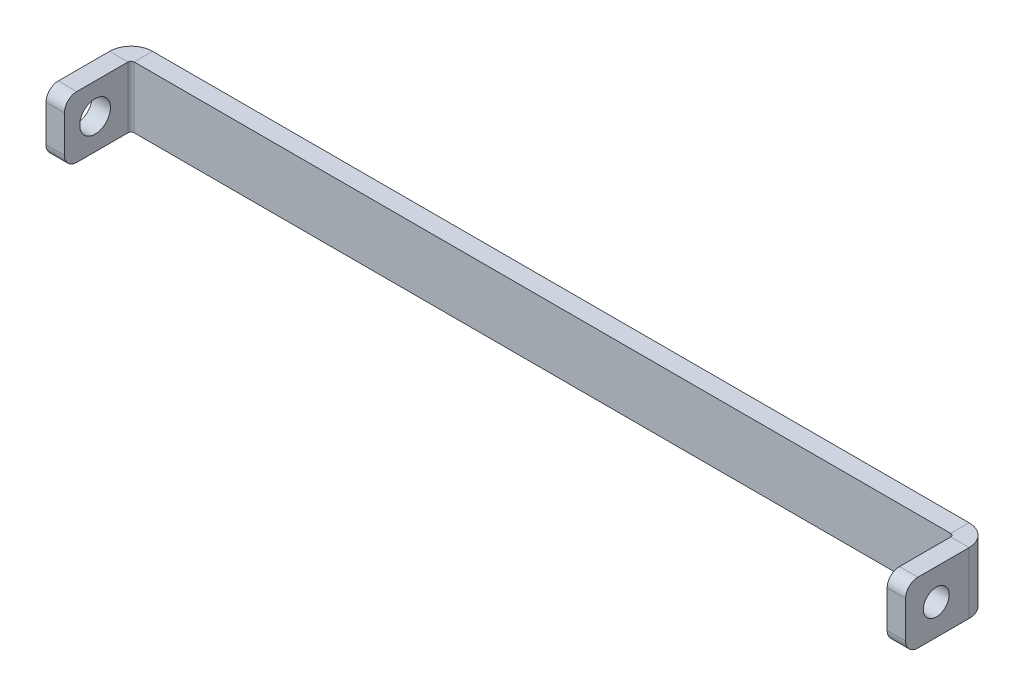
ISO-10303-21;
HEADER;
FILE_DESCRIPTION(('STEP AP214'),'2;1');
FILE_NAME('part.step','',(''),(''),'','','');
FILE_SCHEMA(('AUTOMOTIVE_DESIGN { 1 0 10303 214 1 1 1 1 }'));
ENDSEC;
DATA;
#1=APPLICATION_CONTEXT('core data for automotive mechanical design processes');
#2=APPLICATION_PROTOCOL_DEFINITION('international standard','automotive_design',2000,#1);
#3=PRODUCT_CONTEXT('',#1,'mechanical');
#4=PRODUCT('Part','Part','',(#3));
#5=PRODUCT_RELATED_PRODUCT_CATEGORY('part','',(#4));
#6=PRODUCT_DEFINITION_FORMATION('','',#4);
#7=PRODUCT_DEFINITION_CONTEXT('part definition',#1,'design');
#8=PRODUCT_DEFINITION('design','',#6,#7);
#9=PRODUCT_DEFINITION_SHAPE('','',#8);
#10=(LENGTH_UNIT() NAMED_UNIT(*) SI_UNIT(.MILLI.,.METRE.));
#11=(NAMED_UNIT(*) PLANE_ANGLE_UNIT() SI_UNIT($,.RADIAN.));
#12=(NAMED_UNIT(*) SI_UNIT($,.STERADIAN.) SOLID_ANGLE_UNIT());
#13=UNCERTAINTY_MEASURE_WITH_UNIT(LENGTH_MEASURE(1.E-05),#10,'distance_accuracy_value','');
#14=(GEOMETRIC_REPRESENTATION_CONTEXT(3) GLOBAL_UNCERTAINTY_ASSIGNED_CONTEXT((#13)) GLOBAL_UNIT_ASSIGNED_CONTEXT((#10,
#11,#12)) REPRESENTATION_CONTEXT('',''));
#15=CARTESIAN_POINT('',(0.,0.,0.));
#16=DIRECTION('',(0.,0.,1.));
#17=DIRECTION('',(1.,0.,0.));
#18=AXIS2_PLACEMENT_3D('',#15,#16,#17);
#19=CARTESIAN_POINT('',(89.0480311033268,16.3228628146841,-3.));
#20=DIRECTION('',(0.,0.,-1.));
#21=DIRECTION('',(-1.,0.,0.));
#22=AXIS2_PLACEMENT_3D('',#19,#20,#21);
#23=PLANE('',#22);
#24=DIRECTION('',(-1.,0.,0.));
#25=VECTOR('',#24,1.);
#26=CARTESIAN_POINT('',(-66.9519688966731,24.3228628146841,-3.));
#27=LINE('',#26,#25);
#28=CARTESIAN_POINT('',(77.5480311033269,24.3228628146841,-3.));
#29=VERTEX_POINT('',#28);
#30=CARTESIAN_POINT('',(-55.4519688966732,24.3228628146841,-3.));
#31=VERTEX_POINT('',#30);
#32=EDGE_CURVE('E299',#29,#31,#27,.T.);
#33=ORIENTED_EDGE('',*,*,#32,.F.);
#34=DIRECTION('',(0.,-1.,0.));
#35=VECTOR('',#34,1.);
#36=CARTESIAN_POINT('',(77.5480311033269,16.3228628146841,-3.));
#37=LINE('',#36,#35);
#38=CARTESIAN_POINT('',(77.5480311033269,14.3228628146841,-3.));
#39=VERTEX_POINT('',#38);
#40=EDGE_CURVE('E290',#29,#39,#37,.T.);
#41=ORIENTED_EDGE('',*,*,#40,.T.);
#42=DIRECTION('',(1.,0.,0.));
#43=VECTOR('',#42,1.);
#44=CARTESIAN_POINT('',(89.0480311033268,14.3228628146841,-3.));
#45=LINE('',#44,#43);
#46=CARTESIAN_POINT('',(-55.4519688966732,14.3228628146841,-3.));
#47=VERTEX_POINT('',#46);
#48=EDGE_CURVE('E282',#47,#39,#45,.T.);
#49=ORIENTED_EDGE('',*,*,#48,.F.);
#50=DIRECTION('',(0.,-1.,0.));
#51=VECTOR('',#50,1.);
#52=CARTESIAN_POINT('',(-55.4519688966732,16.3228628146841,-3.));
#53=LINE('',#52,#51);
#54=EDGE_CURVE('E278',#31,#47,#53,.T.);
#55=ORIENTED_EDGE('',*,*,#54,.F.);
#56=EDGE_LOOP('',(#33,#41,#49,#55));
#57=FACE_BOUND('',#56,.T.);
#58=ADVANCED_FACE('F51',(#57),#23,.T.);
#59=CARTESIAN_POINT('',(-66.9519688966731,24.3228628146841,-3.));
#60=DIRECTION('',(0.,1.,0.));
#61=DIRECTION('',(0.,0.,1.));
#62=AXIS2_PLACEMENT_3D('',#59,#60,#61);
#63=PLANE('',#62);
#64=DIRECTION('',(-1.,0.,0.));
#65=VECTOR('',#64,1.);
#66=CARTESIAN_POINT('',(-66.9519688966731,24.3228628146841,0.));
#67=LINE('',#66,#65);
#68=CARTESIAN_POINT('',(77.5480311033269,24.3228628146841,0.));
#69=VERTEX_POINT('',#68);
#70=CARTESIAN_POINT('',(-55.4519688966732,24.3228628146841,0.));
#71=VERTEX_POINT('',#70);
#72=EDGE_CURVE('E74',#69,#71,#67,.T.);
#73=ORIENTED_EDGE('',*,*,#72,.F.);
#74=DIRECTION('',(0.,0.,-1.));
#75=VECTOR('',#74,1.);
#76=CARTESIAN_POINT('',(77.5480311033269,24.3228628146841,-3.));
#77=LINE('',#76,#75);
#78=EDGE_CURVE('E293',#69,#29,#77,.T.);
#79=ORIENTED_EDGE('',*,*,#78,.T.);
#80=ORIENTED_EDGE('',*,*,#32,.T.);
#81=DIRECTION('',(0.,0.,-1.));
#82=VECTOR('',#81,1.);
#83=CARTESIAN_POINT('',(-55.4519688966732,24.3228628146841,-3.));
#84=LINE('',#83,#82);
#85=EDGE_CURVE('E287',#71,#31,#84,.T.);
#86=ORIENTED_EDGE('',*,*,#85,.F.);
#87=EDGE_LOOP('',(#73,#79,#80,#86));
#88=FACE_BOUND('',#87,.T.);
#89=ADVANCED_FACE('F306',(#88),#63,.T.);
#90=CARTESIAN_POINT('',(89.0480311033268,14.3228628146841,-3.));
#91=DIRECTION('',(0.,-1.,0.));
#92=DIRECTION('',(1.,0.,0.));
#93=AXIS2_PLACEMENT_3D('',#90,#91,#92);
#94=PLANE('',#93);
#95=ORIENTED_EDGE('',*,*,#48,.T.);
#96=DIRECTION('',(0.,0.,1.));
#97=VECTOR('',#96,1.);
#98=CARTESIAN_POINT('',(77.5480311033269,14.3228628146841,-3.));
#99=LINE('',#98,#97);
#100=CARTESIAN_POINT('',(77.5480311033269,14.3228628146841,0.));
#101=VERTEX_POINT('',#100);
#102=EDGE_CURVE('E12',#39,#101,#99,.T.);
#103=ORIENTED_EDGE('',*,*,#102,.T.);
#104=DIRECTION('',(1.,0.,0.));
#105=VECTOR('',#104,1.);
#106=CARTESIAN_POINT('',(89.0480311033268,14.3228628146841,0.));
#107=LINE('',#106,#105);
#108=CARTESIAN_POINT('',(-55.4519688966732,14.3228628146841,0.));
#109=VERTEX_POINT('',#108);
#110=EDGE_CURVE('E300',#109,#101,#107,.T.);
#111=ORIENTED_EDGE('',*,*,#110,.F.);
#112=DIRECTION('',(0.,0.,1.));
#113=VECTOR('',#112,1.);
#114=CARTESIAN_POINT('',(-55.4519688966732,14.3228628146841,-3.));
#115=LINE('',#114,#113);
#116=EDGE_CURVE('E281',#47,#109,#115,.T.);
#117=ORIENTED_EDGE('',*,*,#116,.F.);
#118=EDGE_LOOP('',(#95,#103,#111,#117));
#119=FACE_BOUND('',#118,.T.);
#120=ADVANCED_FACE('F53',(#119),#94,.T.);
#121=CARTESIAN_POINT('',(89.0480311033268,16.3228628146841,0.));
#122=DIRECTION('',(0.,0.,-1.));
#123=DIRECTION('',(-1.,0.,0.));
#124=AXIS2_PLACEMENT_3D('',#121,#122,#123);
#125=PLANE('',#124);
#126=DIRECTION('',(0.,-1.,0.));
#127=VECTOR('',#126,1.);
#128=CARTESIAN_POINT('',(77.5480311033269,16.3228628146841,0.));
#129=LINE('',#128,#127);
#130=EDGE_CURVE('E60',#69,#101,#129,.T.);
#131=ORIENTED_EDGE('',*,*,#130,.F.);
#132=ORIENTED_EDGE('',*,*,#72,.T.);
#133=DIRECTION('',(0.,-1.,0.));
#134=VECTOR('',#133,1.);
#135=CARTESIAN_POINT('',(-55.4519688966732,16.3228628146841,0.));
#136=LINE('',#135,#134);
#137=EDGE_CURVE('E285',#71,#109,#136,.T.);
#138=ORIENTED_EDGE('',*,*,#137,.T.);
#139=ORIENTED_EDGE('',*,*,#110,.T.);
#140=EDGE_LOOP('',(#131,#132,#138,#139));
#141=FACE_BOUND('',#140,.T.);
#142=ADVANCED_FACE('F369',(#141),#125,.F.);
#143=CARTESIAN_POINT('',(-55.4519688966732,24.3228628146841,0.5));
#144=DIRECTION('',(0.,1.,0.));
#145=DIRECTION('',(0.,0.,1.));
#146=AXIS2_PLACEMENT_3D('',#143,#144,#145);
#147=PLANE('',#146);
#148=DIRECTION('',(-1.,0.,0.));
#149=VECTOR('',#148,1.);
#150=CARTESIAN_POINT('',(-58.9519688966732,24.3228628146841,0.500000000000014));
#151=LINE('',#150,#149);
#152=CARTESIAN_POINT('',(-55.9519688966732,24.3228628146841,0.5));
#153=VERTEX_POINT('',#152);
#154=CARTESIAN_POINT('',(-58.9519688966732,24.3228628146841,0.499999999999997));
#155=VERTEX_POINT('',#154);
#156=EDGE_CURVE('E221',#153,#155,#151,.T.);
#157=ORIENTED_EDGE('',*,*,#156,.F.);
#158=CARTESIAN_POINT('',(-55.4519688966732,24.322862814684,0.5));
#159=DIRECTION('',(0.,1.,0.));
#160=DIRECTION('',(0.,0.,1.));
#161=AXIS2_PLACEMENT_3D('',#158,#159,#160);
#162=CIRCLE('',#161,0.5);
#163=EDGE_CURVE('E218',#153,#71,#162,.F.);
#164=ORIENTED_EDGE('',*,*,#163,.T.);
#165=ORIENTED_EDGE('',*,*,#85,.T.);
#166=CARTESIAN_POINT('',(-55.4519688966732,24.3228628146841,0.5));
#167=DIRECTION('',(0.,-1.,0.));
#168=DIRECTION('',(0.,0.,1.));
#169=AXIS2_PLACEMENT_3D('',#166,#167,#168);
#170=CIRCLE('',#169,3.5);
#171=EDGE_CURVE('E267',#155,#31,#170,.T.);
#172=ORIENTED_EDGE('',*,*,#171,.F.);
#173=EDGE_LOOP('',(#157,#164,#165,#172));
#174=FACE_BOUND('',#173,.T.);
#175=ADVANCED_FACE('F312',(#174),#147,.T.);
#176=CARTESIAN_POINT('',(-55.4519688966732,14.3228628146841,0.5));
#177=DIRECTION('',(0.,-1.,0.));
#178=DIRECTION('',(0.,0.,-1.));
#179=AXIS2_PLACEMENT_3D('',#176,#177,#178);
#180=PLANE('',#179);
#181=CARTESIAN_POINT('',(-55.4519688966732,14.3228628146841,0.5));
#182=DIRECTION('',(0.,1.,0.));
#183=DIRECTION('',(0.,0.,1.));
#184=AXIS2_PLACEMENT_3D('',#181,#182,#183);
#185=CIRCLE('',#184,0.5);
#186=CARTESIAN_POINT('',(-55.9519688966732,14.3228628146841,0.499999999999987));
#187=VERTEX_POINT('',#186);
#188=EDGE_CURVE('E271',#109,#187,#185,.T.);
#189=ORIENTED_EDGE('',*,*,#188,.T.);
#190=DIRECTION('',(1.,0.,0.));
#191=VECTOR('',#190,1.);
#192=CARTESIAN_POINT('',(-58.9519688966732,14.3228628146841,0.5));
#193=LINE('',#192,#191);
#194=CARTESIAN_POINT('',(-58.9519688966732,14.3228628146841,0.5));
#195=VERTEX_POINT('',#194);
#196=EDGE_CURVE('E236',#195,#187,#193,.T.);
#197=ORIENTED_EDGE('',*,*,#196,.F.);
#198=CARTESIAN_POINT('',(-55.4519688966732,14.3228628146841,0.5));
#199=DIRECTION('',(0.,1.,0.));
#200=DIRECTION('',(0.,0.,-1.));
#201=AXIS2_PLACEMENT_3D('',#198,#199,#200);
#202=CIRCLE('',#201,3.5);
#203=EDGE_CURVE('E270',#47,#195,#202,.T.);
#204=ORIENTED_EDGE('',*,*,#203,.F.);
#205=ORIENTED_EDGE('',*,*,#116,.T.);
#206=EDGE_LOOP('',(#189,#197,#204,#205));
#207=FACE_BOUND('',#206,.T.);
#208=ADVANCED_FACE('F329',(#207),#180,.T.);
#209=CARTESIAN_POINT('',(-55.4519688966732,8.42012901067466,0.5));
#210=DIRECTION('',(0.,1.,0.));
#211=DIRECTION('',(0.,0.,1.));
#212=AXIS2_PLACEMENT_3D('',#209,#210,#211);
#213=CYLINDRICAL_SURFACE('',#212,3.5);
#214=ORIENTED_EDGE('',*,*,#54,.T.);
#215=ORIENTED_EDGE('',*,*,#203,.T.);
#216=DIRECTION('',(0.,-1.,0.));
#217=VECTOR('',#216,1.);
#218=CARTESIAN_POINT('',(-58.9519688966732,16.3228628146841,0.500000000000014));
#219=LINE('',#218,#217);
#220=EDGE_CURVE('E242',#155,#195,#219,.T.);
#221=ORIENTED_EDGE('',*,*,#220,.F.);
#222=ORIENTED_EDGE('',*,*,#171,.T.);
#223=EDGE_LOOP('',(#214,#215,#221,#222));
#224=FACE_BOUND('',#223,.T.);
#225=ADVANCED_FACE('F316',(#224),#213,.T.);
#226=CARTESIAN_POINT('',(-55.4519688966732,8.42012901067466,0.5));
#227=DIRECTION('',(0.,1.,0.));
#228=DIRECTION('',(0.,0.,1.));
#229=AXIS2_PLACEMENT_3D('',#226,#227,#228);
#230=CYLINDRICAL_SURFACE('',#229,0.5);
#231=ORIENTED_EDGE('',*,*,#137,.F.);
#232=ORIENTED_EDGE('',*,*,#163,.F.);
#233=DIRECTION('',(0.,-1.,0.));
#234=VECTOR('',#233,1.);
#235=CARTESIAN_POINT('',(-55.9519688966732,16.3228628146841,0.5));
#236=LINE('',#235,#234);
#237=EDGE_CURVE('E211',#153,#187,#236,.T.);
#238=ORIENTED_EDGE('',*,*,#237,.T.);
#239=ORIENTED_EDGE('',*,*,#188,.F.);
#240=EDGE_LOOP('',(#231,#232,#238,#239));
#241=FACE_BOUND('',#240,.T.);
#242=ADVANCED_FACE('F333',(#241),#230,.F.);
#243=CARTESIAN_POINT('',(-58.9519688966731,22.3228628146841,8.85840734641021));
#244=DIRECTION('',(1.,0.,0.));
#245=DIRECTION('',(0.,0.,-1.));
#246=AXIS2_PLACEMENT_3D('',#243,#244,#245);
#247=CYLINDRICAL_SURFACE('',#246,2.);
#248=CARTESIAN_POINT('',(-55.9519688966731,22.3228628146841,8.85840734641019));
#249=DIRECTION('',(1.,0.,0.));
#250=DIRECTION('',(0.,0.,1.));
#251=AXIS2_PLACEMENT_3D('',#248,#249,#250);
#252=CIRCLE('',#251,2.);
#253=CARTESIAN_POINT('',(-55.9519688966731,24.3228628146841,8.85840734641018));
#254=VERTEX_POINT('',#253);
#255=CARTESIAN_POINT('',(-55.9519688966731,22.322862814684,10.8584073464102));
#256=VERTEX_POINT('',#255);
#257=EDGE_CURVE('E231',#254,#256,#252,.T.);
#258=ORIENTED_EDGE('',*,*,#257,.F.);
#259=DIRECTION('',(1.,0.,0.));
#260=VECTOR('',#259,1.);
#261=CARTESIAN_POINT('',(-58.9519688966731,24.3228628146841,8.85840734641019));
#262=LINE('',#261,#260);
#263=CARTESIAN_POINT('',(-58.9519688966731,24.3228628146841,8.85840734641019));
#264=VERTEX_POINT('',#263);
#265=EDGE_CURVE('E215',#264,#254,#262,.T.);
#266=ORIENTED_EDGE('',*,*,#265,.F.);
#267=CARTESIAN_POINT('',(-58.9519688966731,22.3228628146841,8.85840734641021));
#268=DIRECTION('',(1.,0.,0.));
#269=DIRECTION('',(0.,0.,1.));
#270=AXIS2_PLACEMENT_3D('',#267,#268,#269);
#271=CIRCLE('',#270,2.);
#272=CARTESIAN_POINT('',(-58.9519688966731,22.322862814684,10.8584073464102));
#273=VERTEX_POINT('',#272);
#274=EDGE_CURVE('E262',#264,#273,#271,.T.);
#275=ORIENTED_EDGE('',*,*,#274,.T.);
#276=DIRECTION('',(1.,0.,0.));
#277=VECTOR('',#276,1.);
#278=CARTESIAN_POINT('',(-58.9519688966731,22.322862814684,10.8584073464102));
#279=LINE('',#278,#277);
#280=EDGE_CURVE('E260',#273,#256,#279,.T.);
#281=ORIENTED_EDGE('',*,*,#280,.T.);
#282=EDGE_LOOP('',(#258,#266,#275,#281));
#283=FACE_BOUND('',#282,.T.);
#284=ADVANCED_FACE('F343',(#283),#247,.T.);
#285=CARTESIAN_POINT('',(-58.9519688966731,16.3228628146841,10.8584073464102));
#286=DIRECTION('',(0.,0.,1.));
#287=DIRECTION('',(1.,0.,0.));
#288=AXIS2_PLACEMENT_3D('',#285,#286,#287);
#289=PLANE('',#288);
#290=DIRECTION('',(0.,-1.,0.));
#291=VECTOR('',#290,1.);
#292=CARTESIAN_POINT('',(-55.9519688966731,16.3228628146841,10.8584073464102));
#293=LINE('',#292,#291);
#294=CARTESIAN_POINT('',(-55.9519688966731,16.3228628146841,10.8584073464102));
#295=VERTEX_POINT('',#294);
#296=EDGE_CURVE('E228',#256,#295,#293,.T.);
#297=ORIENTED_EDGE('',*,*,#296,.F.);
#298=ORIENTED_EDGE('',*,*,#280,.F.);
#299=DIRECTION('',(0.,-1.,0.));
#300=VECTOR('',#299,1.);
#301=CARTESIAN_POINT('',(-58.9519688966731,16.3228628146841,10.8584073464102));
#302=LINE('',#301,#300);
#303=CARTESIAN_POINT('',(-58.9519688966731,16.3228628146841,10.8584073464102));
#304=VERTEX_POINT('',#303);
#305=EDGE_CURVE('E257',#273,#304,#302,.T.);
#306=ORIENTED_EDGE('',*,*,#305,.T.);
#307=DIRECTION('',(1.,0.,0.));
#308=VECTOR('',#307,1.);
#309=CARTESIAN_POINT('',(-58.9519688966731,16.3228628146841,10.8584073464102));
#310=LINE('',#309,#308);
#311=EDGE_CURVE('E255',#304,#295,#310,.T.);
#312=ORIENTED_EDGE('',*,*,#311,.T.);
#313=EDGE_LOOP('',(#297,#298,#306,#312));
#314=FACE_BOUND('',#313,.T.);
#315=ADVANCED_FACE('F347',(#314),#289,.T.);
#316=CARTESIAN_POINT('',(-58.9519688966731,16.3228628146841,8.85840734641021));
#317=DIRECTION('',(1.,0.,0.));
#318=DIRECTION('',(0.,0.,-1.));
#319=AXIS2_PLACEMENT_3D('',#316,#317,#318);
#320=CYLINDRICAL_SURFACE('',#319,2.);
#321=CARTESIAN_POINT('',(-55.9519688966731,16.3228628146841,8.85840734641019));
#322=DIRECTION('',(1.,0.,0.));
#323=DIRECTION('',(0.,0.,1.));
#324=AXIS2_PLACEMENT_3D('',#321,#322,#323);
#325=CIRCLE('',#324,2.);
#326=CARTESIAN_POINT('',(-55.9519688966731,14.3228628146841,8.85840734641018));
#327=VERTEX_POINT('',#326);
#328=EDGE_CURVE('E225',#295,#327,#325,.T.);
#329=ORIENTED_EDGE('',*,*,#328,.F.);
#330=ORIENTED_EDGE('',*,*,#311,.F.);
#331=CARTESIAN_POINT('',(-58.9519688966731,16.3228628146841,8.85840734641021));
#332=DIRECTION('',(1.,0.,0.));
#333=DIRECTION('',(0.,0.,1.));
#334=AXIS2_PLACEMENT_3D('',#331,#332,#333);
#335=CIRCLE('',#334,2.);
#336=CARTESIAN_POINT('',(-58.9519688966731,14.3228628146841,8.85840734641019));
#337=VERTEX_POINT('',#336);
#338=EDGE_CURVE('E252',#304,#337,#335,.T.);
#339=ORIENTED_EDGE('',*,*,#338,.T.);
#340=DIRECTION('',(1.,0.,0.));
#341=VECTOR('',#340,1.);
#342=CARTESIAN_POINT('',(-58.9519688966731,14.3228628146841,8.85840734641019));
#343=LINE('',#342,#341);
#344=EDGE_CURVE('E250',#337,#327,#343,.T.);
#345=ORIENTED_EDGE('',*,*,#344,.T.);
#346=EDGE_LOOP('',(#329,#330,#339,#345));
#347=FACE_BOUND('',#346,.T.);
#348=ADVANCED_FACE('F350',(#347),#320,.T.);
#349=CARTESIAN_POINT('',(-58.9519688966731,19.3228628146841,5.8584073464102));
#350=DIRECTION('',(1.,0.,0.));
#351=DIRECTION('',(0.,0.,-1.));
#352=AXIS2_PLACEMENT_3D('',#349,#350,#351);
#353=CYLINDRICAL_SURFACE('',#352,2.5);
#354=CARTESIAN_POINT('',(-58.9519688966731,19.3228628146841,5.8584073464102));
#355=DIRECTION('',(1.,0.,0.));
#356=DIRECTION('',(0.,0.,-1.));
#357=AXIS2_PLACEMENT_3D('',#354,#355,#356);
#358=CIRCLE('',#357,2.5);
#359=CARTESIAN_POINT('',(-58.9519688966732,19.3228628146841,3.3584073464102));
#360=VERTEX_POINT('',#359);
#361=EDGE_CURVE('E244',#360,#360,#358,.T.);
#362=ORIENTED_EDGE('',*,*,#361,.F.);
#363=EDGE_LOOP('',(#362));
#364=FACE_BOUND('',#363,.T.);
#365=CARTESIAN_POINT('',(-55.9519688966732,19.3228628146841,5.85840734641019));
#366=DIRECTION('',(1.,0.,0.));
#367=DIRECTION('',(0.,0.,-1.));
#368=AXIS2_PLACEMENT_3D('',#365,#366,#367);
#369=CIRCLE('',#368,2.5);
#370=CARTESIAN_POINT('',(-55.9519688966732,19.3228628146841,3.35840734641019));
#371=VERTEX_POINT('',#370);
#372=EDGE_CURVE('E247',#371,#371,#369,.T.);
#373=ORIENTED_EDGE('',*,*,#372,.T.);
#374=EDGE_LOOP('',(#373));
#375=FACE_BOUND('',#374,.T.);
#376=ADVANCED_FACE('F352',(#364,#375),#353,.F.);
#377=CARTESIAN_POINT('',(-58.9519688966737,16.3228628146841,-147.14159265359));
#378=DIRECTION('',(-1.,0.,0.));
#379=DIRECTION('',(0.,0.,1.));
#380=AXIS2_PLACEMENT_3D('',#377,#378,#379);
#381=PLANE('',#380);
#382=ORIENTED_EDGE('',*,*,#361,.T.);
#383=EDGE_LOOP('',(#382));
#384=FACE_BOUND('',#383,.T.);
#385=DIRECTION('',(0.,0.,1.));
#386=VECTOR('',#385,1.);
#387=CARTESIAN_POINT('',(-58.9519688966731,24.3228628146841,8.85840734641019));
#388=LINE('',#387,#386);
#389=EDGE_CURVE('E219',#155,#264,#388,.T.);
#390=ORIENTED_EDGE('',*,*,#389,.F.);
#391=ORIENTED_EDGE('',*,*,#220,.T.);
#392=DIRECTION('',(0.,0.,-1.));
#393=VECTOR('',#392,1.);
#394=CARTESIAN_POINT('',(-58.9519688966737,14.3228628146841,-147.14159265359));
#395=LINE('',#394,#393);
#396=EDGE_CURVE('E239',#337,#195,#395,.T.);
#397=ORIENTED_EDGE('',*,*,#396,.F.);
#398=ORIENTED_EDGE('',*,*,#338,.F.);
#399=ORIENTED_EDGE('',*,*,#305,.F.);
#400=ORIENTED_EDGE('',*,*,#274,.F.);
#401=EDGE_LOOP('',(#390,#391,#397,#398,#399,#400));
#402=FACE_BOUND('',#401,.T.);
#403=ADVANCED_FACE('F321',(#384,#402),#381,.T.);
#404=CARTESIAN_POINT('',(-58.9519688966737,14.3228628146841,-147.14159265359));
#405=DIRECTION('',(0.,-1.,0.));
#406=DIRECTION('',(0.,0.,-1.));
#407=AXIS2_PLACEMENT_3D('',#404,#405,#406);
#408=PLANE('',#407);
#409=ORIENTED_EDGE('',*,*,#396,.T.);
#410=ORIENTED_EDGE('',*,*,#196,.T.);
#411=DIRECTION('',(0.,0.,-1.));
#412=VECTOR('',#411,1.);
#413=CARTESIAN_POINT('',(-55.9519688966737,14.3228628146841,-147.14159265359));
#414=LINE('',#413,#412);
#415=EDGE_CURVE('E223',#327,#187,#414,.T.);
#416=ORIENTED_EDGE('',*,*,#415,.F.);
#417=ORIENTED_EDGE('',*,*,#344,.F.);
#418=EDGE_LOOP('',(#409,#410,#416,#417));
#419=FACE_BOUND('',#418,.T.);
#420=ADVANCED_FACE('F326',(#419),#408,.T.);
#421=CARTESIAN_POINT('',(-55.9519688966737,16.3228628146841,-147.14159265359));
#422=DIRECTION('',(-1.,0.,0.));
#423=DIRECTION('',(0.,0.,1.));
#424=AXIS2_PLACEMENT_3D('',#421,#422,#423);
#425=PLANE('',#424);
#426=ORIENTED_EDGE('',*,*,#237,.F.);
#427=DIRECTION('',(0.,0.,1.));
#428=VECTOR('',#427,1.);
#429=CARTESIAN_POINT('',(-55.9519688966731,24.3228628146841,8.85840734641018));
#430=LINE('',#429,#428);
#431=EDGE_CURVE('E234',#153,#254,#430,.T.);
#432=ORIENTED_EDGE('',*,*,#431,.T.);
#433=ORIENTED_EDGE('',*,*,#257,.T.);
#434=ORIENTED_EDGE('',*,*,#296,.T.);
#435=ORIENTED_EDGE('',*,*,#328,.T.);
#436=ORIENTED_EDGE('',*,*,#415,.T.);
#437=EDGE_LOOP('',(#426,#432,#433,#434,#435,#436));
#438=FACE_BOUND('',#437,.T.);
#439=ORIENTED_EDGE('',*,*,#372,.F.);
#440=EDGE_LOOP('',(#439));
#441=FACE_BOUND('',#440,.T.);
#442=ADVANCED_FACE('F336',(#438,#441),#425,.F.);
#443=CARTESIAN_POINT('',(-58.9519688966731,24.3228628146841,8.85840734641019));
#444=DIRECTION('',(0.,1.,0.));
#445=DIRECTION('',(1.,0.,0.));
#446=AXIS2_PLACEMENT_3D('',#443,#444,#445);
#447=PLANE('',#446);
#448=ORIENTED_EDGE('',*,*,#431,.F.);
#449=ORIENTED_EDGE('',*,*,#156,.T.);
#450=ORIENTED_EDGE('',*,*,#389,.T.);
#451=ORIENTED_EDGE('',*,*,#265,.T.);
#452=EDGE_LOOP('',(#448,#449,#450,#451));
#453=FACE_BOUND('',#452,.T.);
#454=ADVANCED_FACE('F339',(#453),#447,.T.);
#455=CARTESIAN_POINT('',(77.5480311033269,24.3228628146841,0.5));
#456=DIRECTION('',(0.,1.,0.));
#457=DIRECTION('',(0.,0.,1.));
#458=AXIS2_PLACEMENT_3D('',#455,#456,#457);
#459=PLANE('',#458);
#460=ORIENTED_EDGE('',*,*,#78,.F.);
#461=CARTESIAN_POINT('',(77.5480311033269,24.3228628146841,0.5));
#462=DIRECTION('',(0.,-1.,0.));
#463=DIRECTION('',(0.,0.,-1.));
#464=AXIS2_PLACEMENT_3D('',#461,#462,#463);
#465=CIRCLE('',#464,0.5);
#466=CARTESIAN_POINT('',(78.0480311033269,24.3228628146841,0.5));
#467=VERTEX_POINT('',#466);
#468=EDGE_CURVE('E186',#69,#467,#465,.T.);
#469=ORIENTED_EDGE('',*,*,#468,.T.);
#470=DIRECTION('',(1.,0.,0.));
#471=VECTOR('',#470,1.);
#472=CARTESIAN_POINT('',(81.0480311033269,24.3228628146841,0.500000000000014));
#473=LINE('',#472,#471);
#474=CARTESIAN_POINT('',(81.0480311033269,24.3228628146841,0.500000000000014));
#475=VERTEX_POINT('',#474);
#476=EDGE_CURVE('E194',#467,#475,#473,.T.);
#477=ORIENTED_EDGE('',*,*,#476,.T.);
#478=CARTESIAN_POINT('',(77.5480311033269,24.3228628146841,0.5));
#479=DIRECTION('',(0.,-1.,0.));
#480=DIRECTION('',(0.,0.,1.));
#481=AXIS2_PLACEMENT_3D('',#478,#479,#480);
#482=CIRCLE('',#481,3.5);
#483=EDGE_CURVE('E204',#29,#475,#482,.T.);
#484=ORIENTED_EDGE('',*,*,#483,.F.);
#485=EDGE_LOOP('',(#460,#469,#477,#484));
#486=FACE_BOUND('',#485,.T.);
#487=ADVANCED_FACE('F395',(#486),#459,.T.);
#488=CARTESIAN_POINT('',(77.5480311033269,14.3228628146841,0.5));
#489=DIRECTION('',(0.,-1.,0.));
#490=DIRECTION('',(0.,0.,-1.));
#491=AXIS2_PLACEMENT_3D('',#488,#489,#490);
#492=PLANE('',#491);
#493=DIRECTION('',(-1.,0.,0.));
#494=VECTOR('',#493,1.);
#495=CARTESIAN_POINT('',(81.0480311033269,14.3228628146841,0.500000000000014));
#496=LINE('',#495,#494);
#497=CARTESIAN_POINT('',(81.0480311033269,14.3228628146841,0.500000000000023));
#498=VERTEX_POINT('',#497);
#499=CARTESIAN_POINT('',(78.0480311033269,14.3228628146841,0.5));
#500=VERTEX_POINT('',#499);
#501=EDGE_CURVE('E174',#498,#500,#496,.T.);
#502=ORIENTED_EDGE('',*,*,#501,.T.);
#503=CARTESIAN_POINT('',(77.5480311033269,14.3228628146841,0.5));
#504=DIRECTION('',(0.,-1.,0.));
#505=DIRECTION('',(0.,0.,-1.));
#506=AXIS2_PLACEMENT_3D('',#503,#504,#505);
#507=CIRCLE('',#506,0.5);
#508=EDGE_CURVE('E208',#500,#101,#507,.F.);
#509=ORIENTED_EDGE('',*,*,#508,.T.);
#510=ORIENTED_EDGE('',*,*,#102,.F.);
#511=CARTESIAN_POINT('',(77.5480311033269,14.3228628146841,0.5));
#512=DIRECTION('',(0.,1.,0.));
#513=DIRECTION('',(0.,0.,-1.));
#514=AXIS2_PLACEMENT_3D('',#511,#512,#513);
#515=CIRCLE('',#514,3.5);
#516=EDGE_CURVE('E207',#498,#39,#515,.T.);
#517=ORIENTED_EDGE('',*,*,#516,.F.);
#518=EDGE_LOOP('',(#502,#509,#510,#517));
#519=FACE_BOUND('',#518,.T.);
#520=ADVANCED_FACE('F378',(#519),#492,.T.);
#521=CARTESIAN_POINT('',(77.5480311033269,30.2255966186935,0.5));
#522=DIRECTION('',(0.,-1.,0.));
#523=DIRECTION('',(0.,0.,-1.));
#524=AXIS2_PLACEMENT_3D('',#521,#522,#523);
#525=CYLINDRICAL_SURFACE('',#524,3.5);
#526=ORIENTED_EDGE('',*,*,#516,.T.);
#527=ORIENTED_EDGE('',*,*,#40,.F.);
#528=ORIENTED_EDGE('',*,*,#483,.T.);
#529=DIRECTION('',(0.,-1.,0.));
#530=VECTOR('',#529,1.);
#531=CARTESIAN_POINT('',(81.0480311033269,16.3228628146841,0.500000000000014));
#532=LINE('',#531,#530);
#533=EDGE_CURVE('E202',#475,#498,#532,.T.);
#534=ORIENTED_EDGE('',*,*,#533,.T.);
#535=EDGE_LOOP('',(#526,#527,#528,#534));
#536=FACE_BOUND('',#535,.T.);
#537=ADVANCED_FACE('F381',(#536),#525,.T.);
#538=CARTESIAN_POINT('',(77.5480311033269,30.2255966186935,0.5));
#539=DIRECTION('',(0.,-1.,0.));
#540=DIRECTION('',(0.,0.,-1.));
#541=AXIS2_PLACEMENT_3D('',#538,#539,#540);
#542=CYLINDRICAL_SURFACE('',#541,0.5);
#543=ORIENTED_EDGE('',*,*,#508,.F.);
#544=DIRECTION('',(0.,-1.,0.));
#545=VECTOR('',#544,1.);
#546=CARTESIAN_POINT('',(78.0480311033269,16.3228628146841,0.5));
#547=LINE('',#546,#545);
#548=EDGE_CURVE('E398',#467,#500,#547,.T.);
#549=ORIENTED_EDGE('',*,*,#548,.F.);
#550=ORIENTED_EDGE('',*,*,#468,.F.);
#551=ORIENTED_EDGE('',*,*,#130,.T.);
#552=EDGE_LOOP('',(#543,#549,#550,#551));
#553=FACE_BOUND('',#552,.T.);
#554=ADVANCED_FACE('F396',(#553),#542,.F.);
#555=CARTESIAN_POINT('',(81.0480311033268,16.3228628146841,8.85840734641019));
#556=DIRECTION('',(-1.,0.,0.));
#557=DIRECTION('',(0.,0.,1.));
#558=AXIS2_PLACEMENT_3D('',#555,#556,#557);
#559=CYLINDRICAL_SURFACE('',#558,2.);
#560=CARTESIAN_POINT('',(78.0480311033268,16.3228628146841,8.85840734641018));
#561=DIRECTION('',(-1.,0.,0.));
#562=DIRECTION('',(0.,0.,-1.));
#563=AXIS2_PLACEMENT_3D('',#560,#561,#562);
#564=CIRCLE('',#563,2.);
#565=CARTESIAN_POINT('',(78.0480311033268,14.3228628146841,8.85840734641016));
#566=VERTEX_POINT('',#565);
#567=CARTESIAN_POINT('',(78.0480311033268,16.3228628146841,10.8584073464102));
#568=VERTEX_POINT('',#567);
#569=EDGE_CURVE('E185',#566,#568,#564,.T.);
#570=ORIENTED_EDGE('',*,*,#569,.F.);
#571=DIRECTION('',(-1.,0.,0.));
#572=VECTOR('',#571,1.);
#573=CARTESIAN_POINT('',(81.0480311033268,14.3228628146841,8.85840734641018));
#574=LINE('',#573,#572);
#575=CARTESIAN_POINT('',(81.0480311033268,14.3228628146841,8.85840734641018));
#576=VERTEX_POINT('',#575);
#577=EDGE_CURVE('E171',#576,#566,#574,.T.);
#578=ORIENTED_EDGE('',*,*,#577,.F.);
#579=CARTESIAN_POINT('',(81.0480311033268,16.3228628146841,8.85840734641019));
#580=DIRECTION('',(-1.,0.,0.));
#581=DIRECTION('',(0.,0.,-1.));
#582=AXIS2_PLACEMENT_3D('',#579,#580,#581);
#583=CIRCLE('',#582,2.);
#584=CARTESIAN_POINT('',(81.0480311033268,16.3228628146841,10.8584073464102));
#585=VERTEX_POINT('',#584);
#586=EDGE_CURVE('E183',#576,#585,#583,.T.);
#587=ORIENTED_EDGE('',*,*,#586,.T.);
#588=DIRECTION('',(-1.,0.,0.));
#589=VECTOR('',#588,1.);
#590=CARTESIAN_POINT('',(81.0480311033268,16.3228628146841,10.8584073464102));
#591=LINE('',#590,#589);
#592=EDGE_CURVE('E193',#585,#568,#591,.T.);
#593=ORIENTED_EDGE('',*,*,#592,.T.);
#594=EDGE_LOOP('',(#570,#578,#587,#593));
#595=FACE_BOUND('',#594,.T.);
#596=ADVANCED_FACE('F182',(#595),#559,.T.);
#597=CARTESIAN_POINT('',(81.0480311033268,22.322862814684,10.8584073464102));
#598=DIRECTION('',(0.,0.,1.));
#599=DIRECTION('',(1.,0.,0.));
#600=AXIS2_PLACEMENT_3D('',#597,#598,#599);
#601=PLANE('',#600);
#602=DIRECTION('',(0.,1.,0.));
#603=VECTOR('',#602,1.);
#604=CARTESIAN_POINT('',(78.0480311033268,22.322862814684,10.8584073464102));
#605=LINE('',#604,#603);
#606=CARTESIAN_POINT('',(78.0480311033268,22.322862814684,10.8584073464102));
#607=VERTEX_POINT('',#606);
#608=EDGE_CURVE('E415',#568,#607,#605,.T.);
#609=ORIENTED_EDGE('',*,*,#608,.F.);
#610=ORIENTED_EDGE('',*,*,#592,.F.);
#611=DIRECTION('',(0.,1.,0.));
#612=VECTOR('',#611,1.);
#613=CARTESIAN_POINT('',(81.0480311033268,22.322862814684,10.8584073464102));
#614=LINE('',#613,#612);
#615=CARTESIAN_POINT('',(81.0480311033268,22.322862814684,10.8584073464102));
#616=VERTEX_POINT('',#615);
#617=EDGE_CURVE('E192',#585,#616,#614,.T.);
#618=ORIENTED_EDGE('',*,*,#617,.T.);
#619=DIRECTION('',(-1.,0.,0.));
#620=VECTOR('',#619,1.);
#621=CARTESIAN_POINT('',(81.0480311033268,22.322862814684,10.8584073464102));
#622=LINE('',#621,#620);
#623=EDGE_CURVE('E409',#616,#607,#622,.T.);
#624=ORIENTED_EDGE('',*,*,#623,.T.);
#625=EDGE_LOOP('',(#609,#610,#618,#624));
#626=FACE_BOUND('',#625,.T.);
#627=ADVANCED_FACE('F412',(#626),#601,.T.);
#628=CARTESIAN_POINT('',(81.0480311033268,22.3228628146841,8.85840734641019));
#629=DIRECTION('',(-1.,0.,0.));
#630=DIRECTION('',(0.,0.,1.));
#631=AXIS2_PLACEMENT_3D('',#628,#629,#630);
#632=CYLINDRICAL_SURFACE('',#631,2.);
#633=CARTESIAN_POINT('',(78.0480311033268,22.3228628146841,8.85840734641018));
#634=DIRECTION('',(-1.,0.,0.));
#635=DIRECTION('',(0.,0.,-1.));
#636=AXIS2_PLACEMENT_3D('',#633,#634,#635);
#637=CIRCLE('',#636,2.);
#638=CARTESIAN_POINT('',(78.0480311033268,24.3228628146841,8.85840734641016));
#639=VERTEX_POINT('',#638);
#640=EDGE_CURVE('E178',#607,#639,#637,.T.);
#641=ORIENTED_EDGE('',*,*,#640,.F.);
#642=ORIENTED_EDGE('',*,*,#623,.F.);
#643=CARTESIAN_POINT('',(81.0480311033268,22.3228628146841,8.85840734641019));
#644=DIRECTION('',(-1.,0.,0.));
#645=DIRECTION('',(0.,0.,-1.));
#646=AXIS2_PLACEMENT_3D('',#643,#644,#645);
#647=CIRCLE('',#646,2.);
#648=CARTESIAN_POINT('',(81.0480311033268,24.3228628146841,8.85840734641018));
#649=VERTEX_POINT('',#648);
#650=EDGE_CURVE('E407',#616,#649,#647,.T.);
#651=ORIENTED_EDGE('',*,*,#650,.T.);
#652=DIRECTION('',(-1.,0.,0.));
#653=VECTOR('',#652,1.);
#654=CARTESIAN_POINT('',(81.0480311033268,24.3228628146841,8.85840734641018));
#655=LINE('',#654,#653);
#656=EDGE_CURVE('E391',#649,#639,#655,.T.);
#657=ORIENTED_EDGE('',*,*,#656,.T.);
#658=EDGE_LOOP('',(#641,#642,#651,#657));
#659=FACE_BOUND('',#658,.T.);
#660=ADVANCED_FACE('F441',(#659),#632,.T.);
#661=CARTESIAN_POINT('',(81.0480311033268,16.3228628146841,8.85840734641019));
#662=DIRECTION('',(1.,0.,0.));
#663=DIRECTION('',(0.,0.,-1.));
#664=AXIS2_PLACEMENT_3D('',#661,#662,#663);
#665=PLANE('',#664);
#666=CARTESIAN_POINT('',(81.0480311033268,19.3228628146841,5.85840734641019));
#667=DIRECTION('',(1.,0.,0.));
#668=DIRECTION('',(0.,0.,-1.));
#669=AXIS2_PLACEMENT_3D('',#666,#667,#668);
#670=CIRCLE('',#669,2.09999999999999);
#671=CARTESIAN_POINT('',(81.0480311033268,19.3228628146841,3.7584073464102));
#672=VERTEX_POINT('',#671);
#673=EDGE_CURVE('E421',#672,#672,#670,.T.);
#674=ORIENTED_EDGE('',*,*,#673,.F.);
#675=EDGE_LOOP('',(#674));
#676=FACE_BOUND('',#675,.T.);
#677=ORIENTED_EDGE('',*,*,#533,.F.);
#678=DIRECTION('',(0.,0.,-1.));
#679=VECTOR('',#678,1.);
#680=CARTESIAN_POINT('',(81.0480311033274,24.3228628146841,-147.14159265359));
#681=LINE('',#680,#679);
#682=EDGE_CURVE('E384',#649,#475,#681,.T.);
#683=ORIENTED_EDGE('',*,*,#682,.F.);
#684=ORIENTED_EDGE('',*,*,#650,.F.);
#685=ORIENTED_EDGE('',*,*,#617,.F.);
#686=ORIENTED_EDGE('',*,*,#586,.F.);
#687=DIRECTION('',(0.,0.,1.));
#688=VECTOR('',#687,1.);
#689=CARTESIAN_POINT('',(81.0480311033268,14.3228628146841,8.85840734641018));
#690=LINE('',#689,#688);
#691=EDGE_CURVE('E168',#498,#576,#690,.T.);
#692=ORIENTED_EDGE('',*,*,#691,.F.);
#693=EDGE_LOOP('',(#677,#683,#684,#685,#686,#692));
#694=FACE_BOUND('',#693,.T.);
#695=ADVANCED_FACE('F189',(#676,#694),#665,.T.);
#696=CARTESIAN_POINT('',(81.0480311033274,24.3228628146841,-147.14159265359));
#697=DIRECTION('',(0.,1.,0.));
#698=DIRECTION('',(-1.,0.,0.));
#699=AXIS2_PLACEMENT_3D('',#696,#697,#698);
#700=PLANE('',#699);
#701=ORIENTED_EDGE('',*,*,#476,.F.);
#702=DIRECTION('',(0.,0.,-1.));
#703=VECTOR('',#702,1.);
#704=CARTESIAN_POINT('',(78.0480311033274,24.3228628146841,-147.14159265359));
#705=LINE('',#704,#703);
#706=EDGE_CURVE('E392',#639,#467,#705,.T.);
#707=ORIENTED_EDGE('',*,*,#706,.F.);
#708=ORIENTED_EDGE('',*,*,#656,.F.);
#709=ORIENTED_EDGE('',*,*,#682,.T.);
#710=EDGE_LOOP('',(#701,#707,#708,#709));
#711=FACE_BOUND('',#710,.T.);
#712=ADVANCED_FACE('F388',(#711),#700,.T.);
#713=CARTESIAN_POINT('',(78.0480311033268,16.3228628146841,8.85840734641018));
#714=DIRECTION('',(1.,0.,0.));
#715=DIRECTION('',(0.,0.,-1.));
#716=AXIS2_PLACEMENT_3D('',#713,#714,#715);
#717=PLANE('',#716);
#718=CARTESIAN_POINT('',(78.0480311033268,19.3228628146841,5.85840734641018));
#719=DIRECTION('',(1.,0.,0.));
#720=DIRECTION('',(0.,0.,-1.));
#721=AXIS2_PLACEMENT_3D('',#718,#719,#720);
#722=CIRCLE('',#721,2.09999999999999);
#723=CARTESIAN_POINT('',(78.0480311033269,19.3228628146841,3.75840734641019));
#724=VERTEX_POINT('',#723);
#725=EDGE_CURVE('E55',#724,#724,#722,.T.);
#726=ORIENTED_EDGE('',*,*,#725,.T.);
#727=EDGE_LOOP('',(#726));
#728=FACE_BOUND('',#727,.T.);
#729=ORIENTED_EDGE('',*,*,#706,.T.);
#730=ORIENTED_EDGE('',*,*,#548,.T.);
#731=DIRECTION('',(0.,0.,1.));
#732=VECTOR('',#731,1.);
#733=CARTESIAN_POINT('',(78.0480311033268,14.3228628146841,8.85840734641016));
#734=LINE('',#733,#732);
#735=EDGE_CURVE('E400',#500,#566,#734,.T.);
#736=ORIENTED_EDGE('',*,*,#735,.T.);
#737=ORIENTED_EDGE('',*,*,#569,.T.);
#738=ORIENTED_EDGE('',*,*,#608,.T.);
#739=ORIENTED_EDGE('',*,*,#640,.T.);
#740=EDGE_LOOP('',(#729,#730,#736,#737,#738,#739));
#741=FACE_BOUND('',#740,.T.);
#742=ADVANCED_FACE('F418',(#728,#741),#717,.F.);
#743=CARTESIAN_POINT('',(81.0480311033268,14.3228628146841,8.85840734641018));
#744=DIRECTION('',(0.,-1.,0.));
#745=DIRECTION('',(0.,0.,1.));
#746=AXIS2_PLACEMENT_3D('',#743,#744,#745);
#747=PLANE('',#746);
#748=ORIENTED_EDGE('',*,*,#501,.F.);
#749=ORIENTED_EDGE('',*,*,#691,.T.);
#750=ORIENTED_EDGE('',*,*,#577,.T.);
#751=ORIENTED_EDGE('',*,*,#735,.F.);
#752=EDGE_LOOP('',(#748,#749,#750,#751));
#753=FACE_BOUND('',#752,.T.);
#754=ADVANCED_FACE('F170',(#753),#747,.T.);
#755=CARTESIAN_POINT('',(81.0480311033268,19.3228628146841,5.85840734641019));
#756=DIRECTION('',(1.,0.,0.));
#757=DIRECTION('',(0.,0.,-1.));
#758=AXIS2_PLACEMENT_3D('',#755,#756,#757);
#759=CYLINDRICAL_SURFACE('',#758,2.09999999999999);
#760=ORIENTED_EDGE('',*,*,#673,.T.);
#761=EDGE_LOOP('',(#760));
#762=FACE_BOUND('',#761,.T.);
#763=ORIENTED_EDGE('',*,*,#725,.F.);
#764=EDGE_LOOP('',(#763));
#765=FACE_BOUND('',#764,.T.);
#766=ADVANCED_FACE('F429',(#762,#765),#759,.F.);
#767=CLOSED_SHELL('',(#58,#89,#120,#142,#175,#208,#225,#242,#284,#315,#348,#376,#403,#420,#442,
#454,#487,#520,#537,#554,#596,#627,#660,#695,#712,#742,#754,#766));
#768=MANIFOLD_SOLID_BREP('B2',#767);
#769=ADVANCED_BREP_SHAPE_REPRESENTATION('',(#18,#768),#14);
#770=SHAPE_DEFINITION_REPRESENTATION(#9,#769);
ENDSEC;
END-ISO-10303-21;
